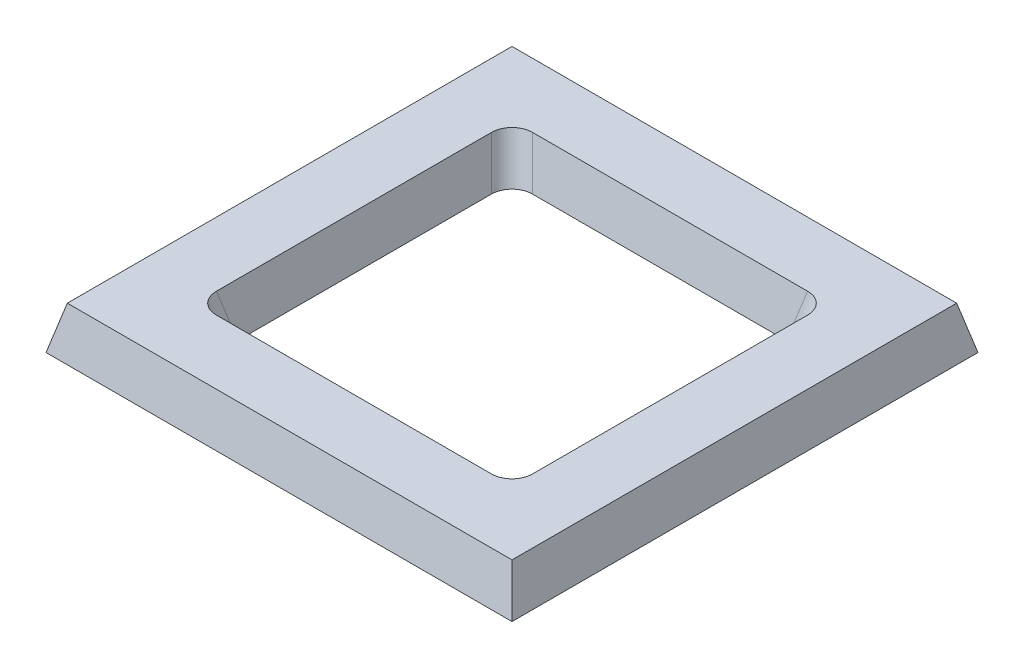
ISO-10303-21;
HEADER;
FILE_DESCRIPTION(('STEP AP214'),'2;1');
FILE_NAME('part.step','',(''),(''),'','','');
FILE_SCHEMA(('AUTOMOTIVE_DESIGN { 1 0 10303 214 1 1 1 1 }'));
ENDSEC;
DATA;
#1=APPLICATION_CONTEXT('core data for automotive mechanical design processes');
#2=APPLICATION_PROTOCOL_DEFINITION('international standard','automotive_design',2000,#1);
#3=PRODUCT_CONTEXT('',#1,'mechanical');
#4=PRODUCT('Part','Part','',(#3));
#5=PRODUCT_RELATED_PRODUCT_CATEGORY('part','',(#4));
#6=PRODUCT_DEFINITION_FORMATION('','',#4);
#7=PRODUCT_DEFINITION_CONTEXT('part definition',#1,'design');
#8=PRODUCT_DEFINITION('design','',#6,#7);
#9=PRODUCT_DEFINITION_SHAPE('','',#8);
#10=(LENGTH_UNIT() NAMED_UNIT(*) SI_UNIT(.MILLI.,.METRE.));
#11=(NAMED_UNIT(*) PLANE_ANGLE_UNIT() SI_UNIT($,.RADIAN.));
#12=(NAMED_UNIT(*) SI_UNIT($,.STERADIAN.) SOLID_ANGLE_UNIT());
#13=UNCERTAINTY_MEASURE_WITH_UNIT(LENGTH_MEASURE(1.E-05),#10,'distance_accuracy_value','');
#14=(GEOMETRIC_REPRESENTATION_CONTEXT(3) GLOBAL_UNCERTAINTY_ASSIGNED_CONTEXT((#13)) GLOBAL_UNIT_ASSIGNED_CONTEXT((#10,
#11,#12)) REPRESENTATION_CONTEXT('',''));
#15=CARTESIAN_POINT('',(0.,0.,0.));
#16=DIRECTION('',(0.,0.,1.));
#17=DIRECTION('',(1.,0.,0.));
#18=AXIS2_PLACEMENT_3D('',#15,#16,#17);
#19=CARTESIAN_POINT('',(0.,10.,0.));
#20=DIRECTION('',(0.,1.,0.));
#21=DIRECTION('',(0.,0.,1.));
#22=AXIS2_PLACEMENT_3D('',#19,#20,#21);
#23=PLANE('',#22);
#24=DIRECTION('',(0.,0.,1.));
#25=VECTOR('',#24,1.);
#26=CARTESIAN_POINT('',(52.0067199715682,10.,0.));
#27=LINE('',#26,#25);
#28=CARTESIAN_POINT('',(52.0067199715682,10.,52.0067199715682));
#29=VERTEX_POINT('',#28);
#30=CARTESIAN_POINT('',(52.0067199715682,10.,-52.0067199715682));
#31=VERTEX_POINT('',#30);
#32=EDGE_CURVE('E196',#29,#31,#27,.F.);
#33=ORIENTED_EDGE('',*,*,#32,.T.);
#34=DIRECTION('',(1.,0.,0.));
#35=VECTOR('',#34,1.);
#36=CARTESIAN_POINT('',(0.,10.,-52.0067199715682));
#37=LINE('',#36,#35);
#38=CARTESIAN_POINT('',(-52.0067199715682,10.,-52.0067199715682));
#39=VERTEX_POINT('',#38);
#40=EDGE_CURVE('E169',#31,#39,#37,.F.);
#41=ORIENTED_EDGE('',*,*,#40,.T.);
#42=DIRECTION('',(0.,0.,-1.));
#43=VECTOR('',#42,1.);
#44=CARTESIAN_POINT('',(-52.0067199715682,10.,0.));
#45=LINE('',#44,#43);
#46=CARTESIAN_POINT('',(-52.0067199715682,10.,52.0067199715682));
#47=VERTEX_POINT('',#46);
#48=EDGE_CURVE('E211',#39,#47,#45,.F.);
#49=ORIENTED_EDGE('',*,*,#48,.T.);
#50=DIRECTION('',(-1.,0.,0.));
#51=VECTOR('',#50,1.);
#52=CARTESIAN_POINT('',(0.,10.,52.0067199715682));
#53=LINE('',#52,#51);
#54=EDGE_CURVE('E201',#47,#29,#53,.F.);
#55=ORIENTED_EDGE('',*,*,#54,.T.);
#56=EDGE_LOOP('',(#33,#41,#49,#55));
#57=FACE_BOUND('',#56,.T.);
#58=DIRECTION('',(-1.,0.,0.));
#59=VECTOR('',#58,1.);
#60=CARTESIAN_POINT('',(-34.5,10.,-36.9932800284318));
#61=LINE('',#60,#59);
#62=CARTESIAN_POINT('',(32.1418013970518,10.,-36.9932800284318));
#63=VERTEX_POINT('',#62);
#64=CARTESIAN_POINT('',(-32.1418013970518,10.,-36.9932800284318));
#65=VERTEX_POINT('',#64);
#66=EDGE_CURVE('E219',#63,#65,#61,.T.);
#67=ORIENTED_EDGE('',*,*,#66,.F.);
#68=CARTESIAN_POINT('',(31.8402118816823,10.,-31.8402118816823));
#69=DIRECTION('',(0.,1.,0.));
#70=DIRECTION('',(0.707106781186548,0.,-0.707106781186548));
#71=AXIS2_PLACEMENT_3D('',#68,#69,#70);
#72=ELLIPSE('',#71,5.30171883921511,5.);
#73=CARTESIAN_POINT('',(36.9932800284318,10.,-32.1418013970518));
#74=VERTEX_POINT('',#73);
#75=EDGE_CURVE('E261',#63,#74,#72,.F.);
#76=ORIENTED_EDGE('',*,*,#75,.T.);
#77=DIRECTION('',(0.,0.,-1.));
#78=VECTOR('',#77,1.);
#79=CARTESIAN_POINT('',(36.9932800284318,10.,34.5));
#80=LINE('',#79,#78);
#81=CARTESIAN_POINT('',(36.9932800284318,10.,32.1418013970518));
#82=VERTEX_POINT('',#81);
#83=EDGE_CURVE('E216',#82,#74,#80,.T.);
#84=ORIENTED_EDGE('',*,*,#83,.F.);
#85=CARTESIAN_POINT('',(31.8402118816823,10.,31.8402118816823));
#86=DIRECTION('',(0.,1.,0.));
#87=DIRECTION('',(0.707106781186548,0.,0.707106781186548));
#88=AXIS2_PLACEMENT_3D('',#85,#86,#87);
#89=ELLIPSE('',#88,5.30171883921511,5.);
#90=CARTESIAN_POINT('',(32.1418013970518,10.,36.9932800284318));
#91=VERTEX_POINT('',#90);
#92=EDGE_CURVE('E255',#82,#91,#89,.F.);
#93=ORIENTED_EDGE('',*,*,#92,.T.);
#94=DIRECTION('',(1.,0.,0.));
#95=VECTOR('',#94,1.);
#96=CARTESIAN_POINT('',(-34.5,10.,36.9932800284318));
#97=LINE('',#96,#95);
#98=CARTESIAN_POINT('',(-32.1418013970518,10.,36.9932800284318));
#99=VERTEX_POINT('',#98);
#100=EDGE_CURVE('E182',#99,#91,#97,.T.);
#101=ORIENTED_EDGE('',*,*,#100,.F.);
#102=CARTESIAN_POINT('',(-31.8402118816823,10.,31.8402118816823));
#103=DIRECTION('',(0.,1.,0.));
#104=DIRECTION('',(-0.707106781186548,0.,0.707106781186548));
#105=AXIS2_PLACEMENT_3D('',#102,#103,#104);
#106=ELLIPSE('',#105,5.30171883921511,5.);
#107=CARTESIAN_POINT('',(-36.9932800284318,10.,32.1418013970518));
#108=VERTEX_POINT('',#107);
#109=EDGE_CURVE('E12',#99,#108,#106,.F.);
#110=ORIENTED_EDGE('',*,*,#109,.T.);
#111=DIRECTION('',(0.,0.,1.));
#112=VECTOR('',#111,1.);
#113=CARTESIAN_POINT('',(-36.9932800284318,10.,34.5));
#114=LINE('',#113,#112);
#115=CARTESIAN_POINT('',(-36.9932800284318,10.,-32.1418013970518));
#116=VERTEX_POINT('',#115);
#117=EDGE_CURVE('E186',#116,#108,#114,.T.);
#118=ORIENTED_EDGE('',*,*,#117,.F.);
#119=CARTESIAN_POINT('',(-31.8402118816823,10.,-31.8402118816823));
#120=DIRECTION('',(0.,1.,0.));
#121=DIRECTION('',(-0.707106781186548,0.,-0.707106781186548));
#122=AXIS2_PLACEMENT_3D('',#119,#120,#121);
#123=ELLIPSE('',#122,5.30171883921511,5.);
#124=EDGE_CURVE('E267',#116,#65,#123,.F.);
#125=ORIENTED_EDGE('',*,*,#124,.T.);
#126=EDGE_LOOP('',(#67,#76,#84,#93,#101,#110,#118,#125));
#127=FACE_BOUND('',#126,.T.);
#128=ADVANCED_FACE('F63',(#57,#127),#23,.T.);
#129=CARTESIAN_POINT('',(0.,0.,0.));
#130=DIRECTION('',(0.,1.,0.));
#131=DIRECTION('',(0.,0.,1.));
#132=AXIS2_PLACEMENT_3D('',#129,#130,#131);
#133=PLANE('',#132);
#134=DIRECTION('',(0.,0.,-1.));
#135=VECTOR('',#134,1.);
#136=CARTESIAN_POINT('',(54.5,0.,0.));
#137=LINE('',#136,#135);
#138=CARTESIAN_POINT('',(54.5,0.,54.5));
#139=VERTEX_POINT('',#138);
#140=CARTESIAN_POINT('',(54.5,0.,-54.5));
#141=VERTEX_POINT('',#140);
#142=EDGE_CURVE('E159',#139,#141,#137,.T.);
#143=ORIENTED_EDGE('',*,*,#142,.F.);
#144=DIRECTION('',(1.,0.,0.));
#145=VECTOR('',#144,1.);
#146=CARTESIAN_POINT('',(0.,0.,54.5));
#147=LINE('',#146,#145);
#148=CARTESIAN_POINT('',(-54.5,0.,54.5));
#149=VERTEX_POINT('',#148);
#150=EDGE_CURVE('E194',#149,#139,#147,.T.);
#151=ORIENTED_EDGE('',*,*,#150,.F.);
#152=DIRECTION('',(0.,0.,1.));
#153=VECTOR('',#152,1.);
#154=CARTESIAN_POINT('',(-54.5,0.,0.));
#155=LINE('',#154,#153);
#156=CARTESIAN_POINT('',(-54.5,0.,-54.5));
#157=VERTEX_POINT('',#156);
#158=EDGE_CURVE('E160',#157,#149,#155,.T.);
#159=ORIENTED_EDGE('',*,*,#158,.F.);
#160=DIRECTION('',(-1.,0.,0.));
#161=VECTOR('',#160,1.);
#162=CARTESIAN_POINT('',(0.,0.,-54.5));
#163=LINE('',#162,#161);
#164=EDGE_CURVE('E153',#141,#157,#163,.T.);
#165=ORIENTED_EDGE('',*,*,#164,.F.);
#166=EDGE_LOOP('',(#143,#151,#159,#165));
#167=FACE_BOUND('',#166,.T.);
#168=DIRECTION('',(1.,0.,0.));
#169=VECTOR('',#168,1.);
#170=CARTESIAN_POINT('',(-34.5,0.,34.5));
#171=LINE('',#170,#169);
#172=CARTESIAN_POINT('',(-29.64852136862,0.,34.5));
#173=VERTEX_POINT('',#172);
#174=CARTESIAN_POINT('',(29.64852136862,0.,34.5));
#175=VERTEX_POINT('',#174);
#176=EDGE_CURVE('E189',#173,#175,#171,.T.);
#177=ORIENTED_EDGE('',*,*,#176,.T.);
#178=CARTESIAN_POINT('',(29.3469318532505,0.,29.3469318532505));
#179=DIRECTION('',(0.,1.,0.));
#180=DIRECTION('',(0.707106781186548,0.,0.707106781186548));
#181=AXIS2_PLACEMENT_3D('',#178,#179,#180);
#182=ELLIPSE('',#181,5.30171883921511,5.);
#183=CARTESIAN_POINT('',(34.5,0.,29.64852136862));
#184=VERTEX_POINT('',#183);
#185=EDGE_CURVE('E252',#175,#184,#182,.T.);
#186=ORIENTED_EDGE('',*,*,#185,.T.);
#187=DIRECTION('',(0.,0.,-1.));
#188=VECTOR('',#187,1.);
#189=CARTESIAN_POINT('',(34.5,0.,34.5));
#190=LINE('',#189,#188);
#191=CARTESIAN_POINT('',(34.5,0.,-29.64852136862));
#192=VERTEX_POINT('',#191);
#193=EDGE_CURVE('E295',#184,#192,#190,.T.);
#194=ORIENTED_EDGE('',*,*,#193,.T.);
#195=CARTESIAN_POINT('',(29.3469318532505,0.,-29.3469318532505));
#196=DIRECTION('',(0.,1.,0.));
#197=DIRECTION('',(0.707106781186548,0.,-0.707106781186548));
#198=AXIS2_PLACEMENT_3D('',#195,#196,#197);
#199=ELLIPSE('',#198,5.30171883921511,5.);
#200=CARTESIAN_POINT('',(29.64852136862,0.,-34.5));
#201=VERTEX_POINT('',#200);
#202=EDGE_CURVE('E258',#192,#201,#199,.T.);
#203=ORIENTED_EDGE('',*,*,#202,.T.);
#204=DIRECTION('',(-1.,0.,0.));
#205=VECTOR('',#204,1.);
#206=CARTESIAN_POINT('',(-34.5,0.,-34.5));
#207=LINE('',#206,#205);
#208=CARTESIAN_POINT('',(-29.64852136862,0.,-34.5));
#209=VERTEX_POINT('',#208);
#210=EDGE_CURVE('E291',#201,#209,#207,.T.);
#211=ORIENTED_EDGE('',*,*,#210,.T.);
#212=CARTESIAN_POINT('',(-29.3469318532505,0.,-29.3469318532505));
#213=DIRECTION('',(0.,1.,0.));
#214=DIRECTION('',(-0.707106781186548,0.,-0.707106781186548));
#215=AXIS2_PLACEMENT_3D('',#212,#213,#214);
#216=ELLIPSE('',#215,5.30171883921511,5.);
#217=CARTESIAN_POINT('',(-34.5,0.,-29.64852136862));
#218=VERTEX_POINT('',#217);
#219=EDGE_CURVE('E264',#209,#218,#216,.T.);
#220=ORIENTED_EDGE('',*,*,#219,.T.);
#221=DIRECTION('',(0.,0.,1.));
#222=VECTOR('',#221,1.);
#223=CARTESIAN_POINT('',(-34.5,0.,34.5));
#224=LINE('',#223,#222);
#225=CARTESIAN_POINT('',(-34.5,0.,29.64852136862));
#226=VERTEX_POINT('',#225);
#227=EDGE_CURVE('E273',#218,#226,#224,.T.);
#228=ORIENTED_EDGE('',*,*,#227,.T.);
#229=CARTESIAN_POINT('',(-29.3469318532505,0.,29.3469318532505));
#230=DIRECTION('',(0.,1.,0.));
#231=DIRECTION('',(-0.707106781186548,0.,0.707106781186548));
#232=AXIS2_PLACEMENT_3D('',#229,#230,#231);
#233=ELLIPSE('',#232,5.30171883921511,5.);
#234=EDGE_CURVE('E72',#226,#173,#233,.T.);
#235=ORIENTED_EDGE('',*,*,#234,.T.);
#236=EDGE_LOOP('',(#177,#186,#194,#203,#211,#220,#228,#235));
#237=FACE_BOUND('',#236,.T.);
#238=ADVANCED_FACE('F155',(#167,#237),#133,.F.);
#239=CARTESIAN_POINT('',(54.5,0.,0.));
#240=DIRECTION('',(0.970295726275996,0.241921895599668,0.));
#241=DIRECTION('',(-0.241921895599668,0.970295726275996,0.));
#242=AXIS2_PLACEMENT_3D('',#239,#240,#241);
#243=PLANE('',#242);
#244=ORIENTED_EDGE('',*,*,#142,.T.);
#245=DIRECTION('',(0.235138839312811,-0.943090373449569,-0.235138839312811));
#246=VECTOR('',#245,1.);
#247=CARTESIAN_POINT('',(51.486680080441,12.0857660800109,-51.486680080441));
#248=LINE('',#247,#246);
#249=EDGE_CURVE('E167',#31,#141,#248,.T.);
#250=ORIENTED_EDGE('',*,*,#249,.F.);
#251=ORIENTED_EDGE('',*,*,#32,.F.);
#252=DIRECTION('',(0.235138839312811,-0.943090373449569,0.235138839312811));
#253=VECTOR('',#252,1.);
#254=CARTESIAN_POINT('',(51.486680080441,12.0857660800109,51.486680080441));
#255=LINE('',#254,#253);
#256=EDGE_CURVE('E180',#29,#139,#255,.T.);
#257=ORIENTED_EDGE('',*,*,#256,.T.);
#258=EDGE_LOOP('',(#244,#250,#251,#257));
#259=FACE_BOUND('',#258,.T.);
#260=ADVANCED_FACE('F178',(#259),#243,.T.);
#261=CARTESIAN_POINT('',(0.,0.,-54.5));
#262=DIRECTION('',(0.,0.241921895599668,-0.970295726275996));
#263=DIRECTION('',(0.,0.970295726275996,0.241921895599668));
#264=AXIS2_PLACEMENT_3D('',#261,#262,#263);
#265=PLANE('',#264);
#266=ORIENTED_EDGE('',*,*,#164,.T.);
#267=DIRECTION('',(-0.235138839312811,-0.943090373449569,-0.235138839312811));
#268=VECTOR('',#267,1.);
#269=CARTESIAN_POINT('',(-51.486680080441,12.0857660800109,-51.486680080441));
#270=LINE('',#269,#268);
#271=EDGE_CURVE('E175',#39,#157,#270,.T.);
#272=ORIENTED_EDGE('',*,*,#271,.F.);
#273=ORIENTED_EDGE('',*,*,#40,.F.);
#274=ORIENTED_EDGE('',*,*,#249,.T.);
#275=EDGE_LOOP('',(#266,#272,#273,#274));
#276=FACE_BOUND('',#275,.T.);
#277=ADVANCED_FACE('F168',(#276),#265,.T.);
#278=CARTESIAN_POINT('',(-54.5,0.,0.));
#279=DIRECTION('',(-0.970295726275996,0.241921895599668,0.));
#280=DIRECTION('',(-0.241921895599668,-0.970295726275996,0.));
#281=AXIS2_PLACEMENT_3D('',#278,#279,#280);
#282=PLANE('',#281);
#283=ORIENTED_EDGE('',*,*,#158,.T.);
#284=DIRECTION('',(-0.235138839312811,-0.943090373449569,0.235138839312811));
#285=VECTOR('',#284,1.);
#286=CARTESIAN_POINT('',(-51.486680080441,12.0857660800109,51.486680080441));
#287=LINE('',#286,#285);
#288=EDGE_CURVE('E200',#47,#149,#287,.T.);
#289=ORIENTED_EDGE('',*,*,#288,.F.);
#290=ORIENTED_EDGE('',*,*,#48,.F.);
#291=ORIENTED_EDGE('',*,*,#271,.T.);
#292=EDGE_LOOP('',(#283,#289,#290,#291));
#293=FACE_BOUND('',#292,.T.);
#294=ADVANCED_FACE('F332',(#293),#282,.T.);
#295=CARTESIAN_POINT('',(0.,0.,54.5));
#296=DIRECTION('',(0.,0.241921895599668,0.970295726275996));
#297=DIRECTION('',(0.,-0.970295726275996,0.241921895599668));
#298=AXIS2_PLACEMENT_3D('',#295,#296,#297);
#299=PLANE('',#298);
#300=ORIENTED_EDGE('',*,*,#150,.T.);
#301=ORIENTED_EDGE('',*,*,#256,.F.);
#302=ORIENTED_EDGE('',*,*,#54,.F.);
#303=ORIENTED_EDGE('',*,*,#288,.T.);
#304=EDGE_LOOP('',(#300,#301,#302,#303));
#305=FACE_BOUND('',#304,.T.);
#306=ADVANCED_FACE('F329',(#305),#299,.T.);
#307=CARTESIAN_POINT('',(34.5,0.,34.5));
#308=DIRECTION('',(-0.970295726275996,0.241921895599668,0.));
#309=DIRECTION('',(-0.241921895599668,-0.970295726275996,0.));
#310=AXIS2_PLACEMENT_3D('',#307,#308,#309);
#311=PLANE('',#310);
#312=ORIENTED_EDGE('',*,*,#193,.F.);
#313=DIRECTION('',(-0.235138839312811,-0.94309037344957,-0.235138839312811));
#314=VECTOR('',#313,1.);
#315=CARTESIAN_POINT('',(37.2615196100695,11.0758501996519,32.4100409786895));
#316=LINE('',#315,#314);
#317=EDGE_CURVE('E236',#184,#82,#316,.F.);
#318=ORIENTED_EDGE('',*,*,#317,.T.);
#319=ORIENTED_EDGE('',*,*,#83,.T.);
#320=DIRECTION('',(-0.235138839312811,-0.94309037344957,0.235138839312811));
#321=VECTOR('',#320,1.);
#322=CARTESIAN_POINT('',(34.7682395816377,1.07585019965193,-29.9167609502577));
#323=LINE('',#322,#321);
#324=EDGE_CURVE('E232',#74,#192,#323,.T.);
#325=ORIENTED_EDGE('',*,*,#324,.T.);
#326=EDGE_LOOP('',(#312,#318,#319,#325));
#327=FACE_BOUND('',#326,.T.);
#328=ADVANCED_FACE('F303',(#327),#311,.T.);
#329=CARTESIAN_POINT('',(-34.5,0.,-34.5));
#330=DIRECTION('',(0.,0.241921895599668,0.970295726275996));
#331=DIRECTION('',(0.,-0.970295726275996,0.241921895599668));
#332=AXIS2_PLACEMENT_3D('',#329,#330,#331);
#333=PLANE('',#332);
#334=ORIENTED_EDGE('',*,*,#210,.F.);
#335=DIRECTION('',(-0.235138839312811,-0.94309037344957,0.235138839312811));
#336=VECTOR('',#335,1.);
#337=CARTESIAN_POINT('',(32.4100409786895,11.0758501996519,-37.2615196100695));
#338=LINE('',#337,#336);
#339=EDGE_CURVE('E243',#201,#63,#338,.F.);
#340=ORIENTED_EDGE('',*,*,#339,.T.);
#341=ORIENTED_EDGE('',*,*,#66,.T.);
#342=DIRECTION('',(0.235138839312811,-0.94309037344957,0.235138839312811));
#343=VECTOR('',#342,1.);
#344=CARTESIAN_POINT('',(-29.9167609502577,1.07585019965193,-34.7682395816377));
#345=LINE('',#344,#343);
#346=EDGE_CURVE('E239',#65,#209,#345,.T.);
#347=ORIENTED_EDGE('',*,*,#346,.T.);
#348=EDGE_LOOP('',(#334,#340,#341,#347));
#349=FACE_BOUND('',#348,.T.);
#350=ADVANCED_FACE('F290',(#349),#333,.T.);
#351=CARTESIAN_POINT('',(-34.5,0.,34.5));
#352=DIRECTION('',(0.970295726275996,0.241921895599668,0.));
#353=DIRECTION('',(-0.241921895599668,0.970295726275996,0.));
#354=AXIS2_PLACEMENT_3D('',#351,#352,#353);
#355=PLANE('',#354);
#356=ORIENTED_EDGE('',*,*,#227,.F.);
#357=DIRECTION('',(0.235138839312811,-0.94309037344957,0.235138839312811));
#358=VECTOR('',#357,1.);
#359=CARTESIAN_POINT('',(-37.2615196100695,11.0758501996519,-32.4100409786895));
#360=LINE('',#359,#358);
#361=EDGE_CURVE('E84',#218,#116,#360,.F.);
#362=ORIENTED_EDGE('',*,*,#361,.T.);
#363=ORIENTED_EDGE('',*,*,#117,.T.);
#364=DIRECTION('',(0.235138839312811,-0.94309037344957,-0.235138839312811));
#365=VECTOR('',#364,1.);
#366=CARTESIAN_POINT('',(-34.7682395816377,1.07585019965193,29.9167609502577));
#367=LINE('',#366,#365);
#368=EDGE_CURVE('E246',#108,#226,#367,.T.);
#369=ORIENTED_EDGE('',*,*,#368,.T.);
#370=EDGE_LOOP('',(#356,#362,#363,#369));
#371=FACE_BOUND('',#370,.T.);
#372=ADVANCED_FACE('F281',(#371),#355,.T.);
#373=CARTESIAN_POINT('',(-34.5,0.,34.5));
#374=DIRECTION('',(0.,0.241921895599668,-0.970295726275996));
#375=DIRECTION('',(0.,0.970295726275996,0.241921895599668));
#376=AXIS2_PLACEMENT_3D('',#373,#374,#375);
#377=PLANE('',#376);
#378=ORIENTED_EDGE('',*,*,#100,.T.);
#379=DIRECTION('',(-0.235138839312811,-0.94309037344957,-0.235138839312811));
#380=VECTOR('',#379,1.);
#381=CARTESIAN_POINT('',(29.9167609502577,1.07585019965192,34.7682395816377));
#382=LINE('',#381,#380);
#383=EDGE_CURVE('E228',#91,#175,#382,.T.);
#384=ORIENTED_EDGE('',*,*,#383,.T.);
#385=ORIENTED_EDGE('',*,*,#176,.F.);
#386=DIRECTION('',(0.235138839312811,-0.94309037344957,-0.235138839312811));
#387=VECTOR('',#386,1.);
#388=CARTESIAN_POINT('',(-32.4100409786895,11.0758501996519,37.2615196100695));
#389=LINE('',#388,#387);
#390=EDGE_CURVE('E174',#173,#99,#389,.F.);
#391=ORIENTED_EDGE('',*,*,#390,.T.);
#392=EDGE_LOOP('',(#378,#384,#385,#391));
#393=FACE_BOUND('',#392,.T.);
#394=ADVANCED_FACE('F278',(#393),#377,.T.);
#395=CARTESIAN_POINT('',(26.1017320612748,-13.0157854511709,26.1017320612747));
#396=DIRECTION('',(0.235138839312811,0.943090373449569,0.235138839312811));
#397=DIRECTION('',(0.,-0.241921895599668,0.970295726275996));
#398=AXIS2_PLACEMENT_3D('',#395,#396,#397);
#399=CYLINDRICAL_SURFACE('',#398,5.);
#400=ORIENTED_EDGE('',*,*,#92,.F.);
#401=ORIENTED_EDGE('',*,*,#317,.F.);
#402=ORIENTED_EDGE('',*,*,#185,.F.);
#403=ORIENTED_EDGE('',*,*,#383,.F.);
#404=EDGE_LOOP('',(#400,#401,#402,#403));
#405=FACE_BOUND('',#404,.T.);
#406=ADVANCED_FACE('F308',(#405),#399,.F.);
#407=CARTESIAN_POINT('',(26.1017320612747,-13.0157854511709,-26.1017320612748));
#408=DIRECTION('',(0.235138839312811,0.943090373449569,-0.235138839312811));
#409=DIRECTION('',(0.,0.241921895599668,0.970295726275996));
#410=AXIS2_PLACEMENT_3D('',#407,#408,#409);
#411=CYLINDRICAL_SURFACE('',#410,5.);
#412=ORIENTED_EDGE('',*,*,#75,.F.);
#413=ORIENTED_EDGE('',*,*,#339,.F.);
#414=ORIENTED_EDGE('',*,*,#202,.F.);
#415=ORIENTED_EDGE('',*,*,#324,.F.);
#416=EDGE_LOOP('',(#412,#413,#414,#415));
#417=FACE_BOUND('',#416,.T.);
#418=ADVANCED_FACE('F311',(#417),#411,.F.);
#419=CARTESIAN_POINT('',(-29.9167609502577,2.28545967765027,-29.9167609502577));
#420=DIRECTION('',(-0.235138839312811,0.943090373449569,-0.235138839312811));
#421=DIRECTION('',(0.,0.241921895599668,0.970295726275996));
#422=AXIS2_PLACEMENT_3D('',#419,#420,#421);
#423=CYLINDRICAL_SURFACE('',#422,5.);
#424=ORIENTED_EDGE('',*,*,#124,.F.);
#425=ORIENTED_EDGE('',*,*,#361,.F.);
#426=ORIENTED_EDGE('',*,*,#219,.F.);
#427=ORIENTED_EDGE('',*,*,#346,.F.);
#428=EDGE_LOOP('',(#424,#425,#426,#427));
#429=FACE_BOUND('',#428,.T.);
#430=ADVANCED_FACE('F286',(#429),#423,.F.);
#431=CARTESIAN_POINT('',(-29.9167609502577,2.28545967765027,29.9167609502577));
#432=DIRECTION('',(-0.235138839312811,0.943090373449569,0.235138839312811));
#433=DIRECTION('',(0.,-0.241921895599668,0.970295726275996));
#434=AXIS2_PLACEMENT_3D('',#431,#432,#433);
#435=CYLINDRICAL_SURFACE('',#434,5.);
#436=ORIENTED_EDGE('',*,*,#109,.F.);
#437=ORIENTED_EDGE('',*,*,#390,.F.);
#438=ORIENTED_EDGE('',*,*,#234,.F.);
#439=ORIENTED_EDGE('',*,*,#368,.F.);
#440=EDGE_LOOP('',(#436,#437,#438,#439));
#441=FACE_BOUND('',#440,.T.);
#442=ADVANCED_FACE('F65',(#441),#435,.F.);
#443=CLOSED_SHELL('',(#128,#238,#260,#277,#294,#306,#328,#350,#372,#394,#406,#418,#430,#442));
#444=MANIFOLD_SOLID_BREP('B2',#443);
#445=ADVANCED_BREP_SHAPE_REPRESENTATION('',(#18,#444),#14);
#446=SHAPE_DEFINITION_REPRESENTATION(#9,#445);
ENDSEC;
END-ISO-10303-21;
